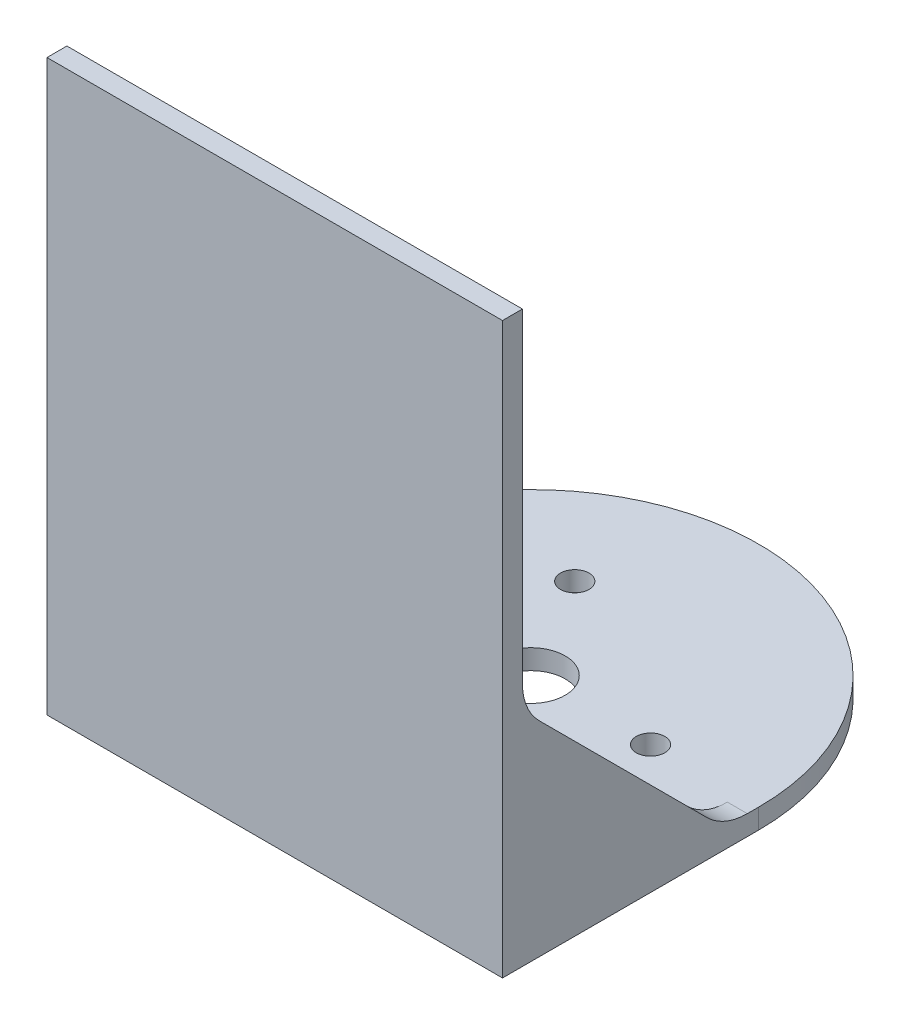
ISO-10303-21;
HEADER;
FILE_DESCRIPTION(('STEP AP214'),'2;1');
FILE_NAME('part.step','',(''),(''),'','','');
FILE_SCHEMA(('AUTOMOTIVE_DESIGN { 1 0 10303 214 1 1 1 1 }'));
ENDSEC;
DATA;
#1=APPLICATION_CONTEXT('core data for automotive mechanical design processes');
#2=APPLICATION_PROTOCOL_DEFINITION('international standard','automotive_design',2000,#1);
#3=PRODUCT_CONTEXT('',#1,'mechanical');
#4=PRODUCT('Part','Part','',(#3));
#5=PRODUCT_RELATED_PRODUCT_CATEGORY('part','',(#4));
#6=PRODUCT_DEFINITION_FORMATION('','',#4);
#7=PRODUCT_DEFINITION_CONTEXT('part definition',#1,'design');
#8=PRODUCT_DEFINITION('design','',#6,#7);
#9=PRODUCT_DEFINITION_SHAPE('','',#8);
#10=(LENGTH_UNIT() NAMED_UNIT(*) SI_UNIT(.MILLI.,.METRE.));
#11=(NAMED_UNIT(*) PLANE_ANGLE_UNIT() SI_UNIT($,.RADIAN.));
#12=(NAMED_UNIT(*) SI_UNIT($,.STERADIAN.) SOLID_ANGLE_UNIT());
#13=UNCERTAINTY_MEASURE_WITH_UNIT(LENGTH_MEASURE(1.E-05),#10,'distance_accuracy_value','');
#14=(GEOMETRIC_REPRESENTATION_CONTEXT(3) GLOBAL_UNCERTAINTY_ASSIGNED_CONTEXT((#13)) GLOBAL_UNIT_ASSIGNED_CONTEXT((#10,
#11,#12)) REPRESENTATION_CONTEXT('',''));
#15=CARTESIAN_POINT('',(0.,0.,0.));
#16=DIRECTION('',(0.,0.,1.));
#17=DIRECTION('',(1.,0.,0.));
#18=AXIS2_PLACEMENT_3D('',#15,#16,#17);
#19=CARTESIAN_POINT('',(0.,3.5,0.));
#20=DIRECTION('',(0.,1.,0.));
#21=DIRECTION('',(0.,0.,1.));
#22=AXIS2_PLACEMENT_3D('',#19,#20,#21);
#23=PLANE('',#22);
#24=CARTESIAN_POINT('',(-10.4999999999998,3.5,-18.1865334794733));
#25=DIRECTION('',(0.,1.,0.));
#26=DIRECTION('',(0.,0.,1.));
#27=AXIS2_PLACEMENT_3D('',#24,#25,#26);
#28=CIRCLE('',#27,2.5);
#29=CARTESIAN_POINT('',(-10.4999999999998,3.5,-15.6865334794733));
#30=VERTEX_POINT('',#29);
#31=EDGE_CURVE('E201',#30,#30,#28,.T.);
#32=ORIENTED_EDGE('',*,*,#31,.F.);
#33=EDGE_LOOP('',(#32));
#34=FACE_BOUND('',#33,.T.);
#35=CARTESIAN_POINT('',(21.,3.5,0.));
#36=DIRECTION('',(0.,1.,0.));
#37=DIRECTION('',(0.,0.,1.));
#38=AXIS2_PLACEMENT_3D('',#35,#36,#37);
#39=CIRCLE('',#38,2.5);
#40=CARTESIAN_POINT('',(21.,3.5,2.5));
#41=VERTEX_POINT('',#40);
#42=EDGE_CURVE('E255',#41,#41,#39,.T.);
#43=ORIENTED_EDGE('',*,*,#42,.F.);
#44=EDGE_LOOP('',(#43));
#45=FACE_BOUND('',#44,.T.);
#46=CARTESIAN_POINT('',(-10.5000000000001,3.5,18.1865334794732));
#47=DIRECTION('',(0.,1.,0.));
#48=DIRECTION('',(0.,0.,1.));
#49=AXIS2_PLACEMENT_3D('',#46,#47,#48);
#50=CIRCLE('',#49,2.5);
#51=CARTESIAN_POINT('',(-10.5000000000001,3.5,20.6865334794732));
#52=VERTEX_POINT('',#51);
#53=EDGE_CURVE('E168',#52,#52,#50,.T.);
#54=ORIENTED_EDGE('',*,*,#53,.F.);
#55=EDGE_LOOP('',(#54));
#56=FACE_BOUND('',#55,.T.);
#57=CARTESIAN_POINT('',(0.,3.5,0.));
#58=DIRECTION('',(0.,1.,0.));
#59=DIRECTION('',(0.,0.,1.));
#60=AXIS2_PLACEMENT_3D('',#57,#58,#59);
#61=CIRCLE('',#60,6.);
#62=CARTESIAN_POINT('',(0.,3.5,6.));
#63=VERTEX_POINT('',#62);
#64=EDGE_CURVE('E176',#63,#63,#61,.T.);
#65=ORIENTED_EDGE('',*,*,#64,.F.);
#66=EDGE_LOOP('',(#65));
#67=FACE_BOUND('',#66,.T.);
#68=DIRECTION('',(0.,0.,1.));
#69=VECTOR('',#68,1.);
#70=CARTESIAN_POINT('',(36.5,3.5,6.14466094067268));
#71=LINE('',#70,#69);
#72=CARTESIAN_POINT('',(36.5,3.5,2.00252531694172));
#73=VERTEX_POINT('',#72);
#74=CARTESIAN_POINT('',(36.5,3.5,41.5));
#75=VERTEX_POINT('',#74);
#76=EDGE_CURVE('E238',#73,#75,#71,.T.);
#77=ORIENTED_EDGE('',*,*,#76,.F.);
#78=DIRECTION('',(1.,0.,0.));
#79=VECTOR('',#78,1.);
#80=CARTESIAN_POINT('',(0.,3.5,2.00252531694172));
#81=LINE('',#80,#79);
#82=CARTESIAN_POINT('',(40.,3.5,2.00252531694172));
#83=VERTEX_POINT('',#82);
#84=EDGE_CURVE('E220',#73,#83,#81,.T.);
#85=ORIENTED_EDGE('',*,*,#84,.T.);
#86=DIRECTION('',(0.,0.,-1.));
#87=VECTOR('',#86,1.);
#88=CARTESIAN_POINT('',(40.,3.5,0.));
#89=LINE('',#88,#87);
#90=CARTESIAN_POINT('',(40.,3.5,0.));
#91=VERTEX_POINT('',#90);
#92=EDGE_CURVE('E165',#83,#91,#89,.T.);
#93=ORIENTED_EDGE('',*,*,#92,.T.);
#94=CARTESIAN_POINT('',(0.,3.5,0.));
#95=DIRECTION('',(0.,1.,0.));
#96=DIRECTION('',(0.,0.,1.));
#97=AXIS2_PLACEMENT_3D('',#94,#95,#96);
#98=CIRCLE('',#97,40.);
#99=CARTESIAN_POINT('',(-40.,3.5,0.));
#100=VERTEX_POINT('',#99);
#101=EDGE_CURVE('E170',#100,#91,#98,.F.);
#102=ORIENTED_EDGE('',*,*,#101,.F.);
#103=DIRECTION('',(0.,0.,1.));
#104=VECTOR('',#103,1.);
#105=CARTESIAN_POINT('',(-40.,3.5,0.));
#106=LINE('',#105,#104);
#107=CARTESIAN_POINT('',(-40.,3.5,2.00252531694172));
#108=VERTEX_POINT('',#107);
#109=EDGE_CURVE('E166',#100,#108,#106,.T.);
#110=ORIENTED_EDGE('',*,*,#109,.T.);
#111=DIRECTION('',(-1.,0.,0.));
#112=VECTOR('',#111,1.);
#113=CARTESIAN_POINT('',(-36.5,3.5,2.00252531694172));
#114=LINE('',#113,#112);
#115=CARTESIAN_POINT('',(-36.5,3.5,2.00252531694172));
#116=VERTEX_POINT('',#115);
#117=EDGE_CURVE('E160',#108,#116,#114,.F.);
#118=ORIENTED_EDGE('',*,*,#117,.T.);
#119=DIRECTION('',(0.,0.,1.));
#120=VECTOR('',#119,1.);
#121=CARTESIAN_POINT('',(-36.5,3.5,6.14466094067268));
#122=LINE('',#121,#120);
#123=CARTESIAN_POINT('',(-36.5,3.5,41.5));
#124=VERTEX_POINT('',#123);
#125=EDGE_CURVE('E144',#116,#124,#122,.T.);
#126=ORIENTED_EDGE('',*,*,#125,.T.);
#127=DIRECTION('',(1.,0.,0.));
#128=VECTOR('',#127,1.);
#129=CARTESIAN_POINT('',(0.,3.5,41.5));
#130=LINE('',#129,#128);
#131=EDGE_CURVE('E157',#124,#75,#130,.T.);
#132=ORIENTED_EDGE('',*,*,#131,.T.);
#133=EDGE_LOOP('',(#77,#85,#93,#102,#110,#118,#126,#132));
#134=FACE_BOUND('',#133,.T.);
#135=ADVANCED_FACE('F42',(#34,#45,#56,#67,#134),#23,.T.);
#136=CARTESIAN_POINT('',(0.,100.,41.5));
#137=DIRECTION('',(0.,0.,-1.));
#138=DIRECTION('',(-1.,0.,0.));
#139=AXIS2_PLACEMENT_3D('',#136,#137,#138);
#140=PLANE('',#139);
#141=DIRECTION('',(0.,-1.,0.));
#142=VECTOR('',#141,1.);
#143=CARTESIAN_POINT('',(40.,100.,41.5));
#144=LINE('',#143,#142);
#145=CARTESIAN_POINT('',(40.,100.,41.5));
#146=VERTEX_POINT('',#145);
#147=CARTESIAN_POINT('',(40.,42.9974746830584,41.5));
#148=VERTEX_POINT('',#147);
#149=EDGE_CURVE('E268',#146,#148,#144,.T.);
#150=ORIENTED_EDGE('',*,*,#149,.T.);
#151=DIRECTION('',(1.,0.,0.));
#152=VECTOR('',#151,1.);
#153=CARTESIAN_POINT('',(0.,42.9974746830584,41.5));
#154=LINE('',#153,#152);
#155=CARTESIAN_POINT('',(36.5,42.9974746830584,41.5));
#156=VERTEX_POINT('',#155);
#157=EDGE_CURVE('E228',#148,#156,#154,.F.);
#158=ORIENTED_EDGE('',*,*,#157,.T.);
#159=DIRECTION('',(0.,1.,0.));
#160=VECTOR('',#159,1.);
#161=CARTESIAN_POINT('',(36.5,3.5,41.5));
#162=LINE('',#161,#160);
#163=EDGE_CURVE('E56',#75,#156,#162,.T.);
#164=ORIENTED_EDGE('',*,*,#163,.F.);
#165=ORIENTED_EDGE('',*,*,#131,.F.);
#166=DIRECTION('',(0.,1.,0.));
#167=VECTOR('',#166,1.);
#168=CARTESIAN_POINT('',(-36.5,3.5,41.5));
#169=LINE('',#168,#167);
#170=CARTESIAN_POINT('',(-36.5,42.9974746830584,41.5));
#171=VERTEX_POINT('',#170);
#172=EDGE_CURVE('E141',#124,#171,#169,.T.);
#173=ORIENTED_EDGE('',*,*,#172,.T.);
#174=DIRECTION('',(-1.,0.,0.));
#175=VECTOR('',#174,1.);
#176=CARTESIAN_POINT('',(-40.,42.9974746830584,41.5));
#177=LINE('',#176,#175);
#178=CARTESIAN_POINT('',(-40.,42.9974746830584,41.5));
#179=VERTEX_POINT('',#178);
#180=EDGE_CURVE('E211',#171,#179,#177,.T.);
#181=ORIENTED_EDGE('',*,*,#180,.T.);
#182=DIRECTION('',(0.,-1.,0.));
#183=VECTOR('',#182,1.);
#184=CARTESIAN_POINT('',(-40.,100.,41.5));
#185=LINE('',#184,#183);
#186=CARTESIAN_POINT('',(-40.,100.,41.5));
#187=VERTEX_POINT('',#186);
#188=EDGE_CURVE('E184',#187,#179,#185,.T.);
#189=ORIENTED_EDGE('',*,*,#188,.F.);
#190=DIRECTION('',(1.,0.,0.));
#191=VECTOR('',#190,1.);
#192=CARTESIAN_POINT('',(0.,100.,41.5));
#193=LINE('',#192,#191);
#194=EDGE_CURVE('E274',#187,#146,#193,.T.);
#195=ORIENTED_EDGE('',*,*,#194,.T.);
#196=EDGE_LOOP('',(#150,#158,#164,#165,#173,#181,#189,#195));
#197=FACE_BOUND('',#196,.T.);
#198=ADVANCED_FACE('F164',(#197),#140,.T.);
#199=CARTESIAN_POINT('',(0.,3.5,0.));
#200=DIRECTION('',(0.,-1.,0.));
#201=DIRECTION('',(0.,0.,-1.));
#202=AXIS2_PLACEMENT_3D('',#199,#200,#201);
#203=CYLINDRICAL_SURFACE('',#202,40.);
#204=CARTESIAN_POINT('',(0.,0.,0.));
#205=DIRECTION('',(0.,1.,0.));
#206=DIRECTION('',(0.,0.,1.));
#207=AXIS2_PLACEMENT_3D('',#204,#205,#206);
#208=CIRCLE('',#207,40.);
#209=CARTESIAN_POINT('',(-40.,0.,0.));
#210=VERTEX_POINT('',#209);
#211=CARTESIAN_POINT('',(40.,0.,0.));
#212=VERTEX_POINT('',#211);
#213=EDGE_CURVE('E187',#210,#212,#208,.F.);
#214=ORIENTED_EDGE('',*,*,#213,.F.);
#215=DIRECTION('',(0.,-1.,0.));
#216=VECTOR('',#215,1.);
#217=CARTESIAN_POINT('',(-40.,3.5,0.));
#218=LINE('',#217,#216);
#219=EDGE_CURVE('E203',#100,#210,#218,.T.);
#220=ORIENTED_EDGE('',*,*,#219,.F.);
#221=ORIENTED_EDGE('',*,*,#101,.T.);
#222=DIRECTION('',(0.,-1.,0.));
#223=VECTOR('',#222,1.);
#224=CARTESIAN_POINT('',(40.,3.5,0.));
#225=LINE('',#224,#223);
#226=EDGE_CURVE('E179',#91,#212,#225,.T.);
#227=ORIENTED_EDGE('',*,*,#226,.T.);
#228=EDGE_LOOP('',(#214,#220,#221,#227));
#229=FACE_BOUND('',#228,.T.);
#230=ADVANCED_FACE('F253',(#229),#203,.T.);
#231=CARTESIAN_POINT('',(-40.,3.5,0.));
#232=DIRECTION('',(1.,0.,0.));
#233=DIRECTION('',(0.,0.,-1.));
#234=AXIS2_PLACEMENT_3D('',#231,#232,#233);
#235=PLANE('',#234);
#236=DIRECTION('',(0.,0.,1.));
#237=VECTOR('',#236,1.);
#238=CARTESIAN_POINT('',(-40.,0.,0.));
#239=LINE('',#238,#237);
#240=CARTESIAN_POINT('',(-40.,0.,45.));
#241=VERTEX_POINT('',#240);
#242=EDGE_CURVE('E190',#210,#241,#239,.T.);
#243=ORIENTED_EDGE('',*,*,#242,.T.);
#244=DIRECTION('',(0.,-1.,0.));
#245=VECTOR('',#244,1.);
#246=CARTESIAN_POINT('',(-40.,100.,45.));
#247=LINE('',#246,#245);
#248=CARTESIAN_POINT('',(-40.,100.,45.));
#249=VERTEX_POINT('',#248);
#250=EDGE_CURVE('E263',#249,#241,#247,.T.);
#251=ORIENTED_EDGE('',*,*,#250,.F.);
#252=DIRECTION('',(0.,0.,1.));
#253=VECTOR('',#252,1.);
#254=CARTESIAN_POINT('',(-40.,100.,0.));
#255=LINE('',#254,#253);
#256=EDGE_CURVE('E278',#187,#249,#255,.T.);
#257=ORIENTED_EDGE('',*,*,#256,.F.);
#258=ORIENTED_EDGE('',*,*,#188,.T.);
#259=CARTESIAN_POINT('',(-40.,42.9974746830584,31.5));
#260=DIRECTION('',(1.,0.,0.));
#261=DIRECTION('',(0.,0.,-1.));
#262=AXIS2_PLACEMENT_3D('',#259,#260,#261);
#263=CIRCLE('',#262,10.);
#264=CARTESIAN_POINT('',(-40.,35.9264068711929,38.5710678118655));
#265=VERTEX_POINT('',#264);
#266=EDGE_CURVE('E217',#179,#265,#263,.T.);
#267=ORIENTED_EDGE('',*,*,#266,.T.);
#268=DIRECTION('',(0.,-0.707106781186549,-0.707106781186546));
#269=VECTOR('',#268,1.);
#270=CARTESIAN_POINT('',(-40.,3.5,6.14466094067268));
#271=LINE('',#270,#269);
#272=CARTESIAN_POINT('',(-40.,6.42893218813454,9.07359312880721));
#273=VERTEX_POINT('',#272);
#274=EDGE_CURVE('E162',#265,#273,#271,.T.);
#275=ORIENTED_EDGE('',*,*,#274,.T.);
#276=CARTESIAN_POINT('',(-40.,13.5,2.00252531694172));
#277=DIRECTION('',(1.,0.,0.));
#278=DIRECTION('',(0.,0.,-1.));
#279=AXIS2_PLACEMENT_3D('',#276,#277,#278);
#280=CIRCLE('',#279,10.);
#281=EDGE_CURVE('E213',#273,#108,#280,.T.);
#282=ORIENTED_EDGE('',*,*,#281,.T.);
#283=ORIENTED_EDGE('',*,*,#109,.F.);
#284=ORIENTED_EDGE('',*,*,#219,.T.);
#285=EDGE_LOOP('',(#243,#251,#257,#258,#267,#275,#282,#283,#284));
#286=FACE_BOUND('',#285,.T.);
#287=ADVANCED_FACE('F312',(#286),#235,.F.);
#288=CARTESIAN_POINT('',(-10.5000000000001,3.5,18.1865334794732));
#289=DIRECTION('',(0.,-1.,0.));
#290=DIRECTION('',(0.,0.,-1.));
#291=AXIS2_PLACEMENT_3D('',#288,#289,#290);
#292=CYLINDRICAL_SURFACE('',#291,2.5);
#293=ORIENTED_EDGE('',*,*,#53,.T.);
#294=EDGE_LOOP('',(#293));
#295=FACE_BOUND('',#294,.T.);
#296=CARTESIAN_POINT('',(-10.5000000000001,0.,18.1865334794732));
#297=DIRECTION('',(0.,1.,0.));
#298=DIRECTION('',(0.,0.,1.));
#299=AXIS2_PLACEMENT_3D('',#296,#297,#298);
#300=CIRCLE('',#299,2.5);
#301=CARTESIAN_POINT('',(-10.5000000000001,0.,20.6865334794732));
#302=VERTEX_POINT('',#301);
#303=EDGE_CURVE('E195',#302,#302,#300,.T.);
#304=ORIENTED_EDGE('',*,*,#303,.F.);
#305=EDGE_LOOP('',(#304));
#306=FACE_BOUND('',#305,.T.);
#307=ADVANCED_FACE('F349',(#295,#306),#292,.F.);
#308=CARTESIAN_POINT('',(40.,3.5,0.));
#309=DIRECTION('',(-1.,0.,0.));
#310=DIRECTION('',(0.,0.,1.));
#311=AXIS2_PLACEMENT_3D('',#308,#309,#310);
#312=PLANE('',#311);
#313=ORIENTED_EDGE('',*,*,#92,.F.);
#314=CARTESIAN_POINT('',(40.,13.5,2.00252531694172));
#315=DIRECTION('',(-1.,0.,0.));
#316=DIRECTION('',(0.,0.,1.));
#317=AXIS2_PLACEMENT_3D('',#314,#315,#316);
#318=CIRCLE('',#317,10.);
#319=CARTESIAN_POINT('',(40.,6.42893218813454,9.07359312880721));
#320=VERTEX_POINT('',#319);
#321=EDGE_CURVE('E230',#83,#320,#318,.T.);
#322=ORIENTED_EDGE('',*,*,#321,.T.);
#323=DIRECTION('',(0.,-0.707106781186549,-0.707106781186546));
#324=VECTOR('',#323,1.);
#325=CARTESIAN_POINT('',(40.,3.5,6.14466094067268));
#326=LINE('',#325,#324);
#327=CARTESIAN_POINT('',(40.,35.9264068711929,38.5710678118655));
#328=VERTEX_POINT('',#327);
#329=EDGE_CURVE('E286',#328,#320,#326,.T.);
#330=ORIENTED_EDGE('',*,*,#329,.F.);
#331=CARTESIAN_POINT('',(40.,42.9974746830584,31.5));
#332=DIRECTION('',(-1.,0.,0.));
#333=DIRECTION('',(0.,0.,1.));
#334=AXIS2_PLACEMENT_3D('',#331,#332,#333);
#335=CIRCLE('',#334,10.);
#336=EDGE_CURVE('E50',#328,#148,#335,.T.);
#337=ORIENTED_EDGE('',*,*,#336,.T.);
#338=ORIENTED_EDGE('',*,*,#149,.F.);
#339=DIRECTION('',(0.,0.,-1.));
#340=VECTOR('',#339,1.);
#341=CARTESIAN_POINT('',(40.,100.,0.));
#342=LINE('',#341,#340);
#343=CARTESIAN_POINT('',(40.,100.,45.));
#344=VERTEX_POINT('',#343);
#345=EDGE_CURVE('E270',#344,#146,#342,.T.);
#346=ORIENTED_EDGE('',*,*,#345,.F.);
#347=DIRECTION('',(0.,-1.,0.));
#348=VECTOR('',#347,1.);
#349=CARTESIAN_POINT('',(40.,100.,45.));
#350=LINE('',#349,#348);
#351=CARTESIAN_POINT('',(40.,0.,45.));
#352=VERTEX_POINT('',#351);
#353=EDGE_CURVE('E266',#344,#352,#350,.T.);
#354=ORIENTED_EDGE('',*,*,#353,.T.);
#355=DIRECTION('',(0.,0.,-1.));
#356=VECTOR('',#355,1.);
#357=CARTESIAN_POINT('',(40.,0.,0.));
#358=LINE('',#357,#356);
#359=EDGE_CURVE('E192',#352,#212,#358,.T.);
#360=ORIENTED_EDGE('',*,*,#359,.T.);
#361=ORIENTED_EDGE('',*,*,#226,.F.);
#362=EDGE_LOOP('',(#313,#322,#330,#337,#338,#346,#354,#360,#361));
#363=FACE_BOUND('',#362,.T.);
#364=ADVANCED_FACE('F247',(#363),#312,.F.);
#365=CARTESIAN_POINT('',(21.,3.5,0.));
#366=DIRECTION('',(0.,-1.,0.));
#367=DIRECTION('',(0.,0.,-1.));
#368=AXIS2_PLACEMENT_3D('',#365,#366,#367);
#369=CYLINDRICAL_SURFACE('',#368,2.5);
#370=ORIENTED_EDGE('',*,*,#42,.T.);
#371=EDGE_LOOP('',(#370));
#372=FACE_BOUND('',#371,.T.);
#373=CARTESIAN_POINT('',(21.,0.,0.));
#374=DIRECTION('',(0.,1.,0.));
#375=DIRECTION('',(0.,0.,1.));
#376=AXIS2_PLACEMENT_3D('',#373,#374,#375);
#377=CIRCLE('',#376,2.5);
#378=CARTESIAN_POINT('',(21.,0.,2.5));
#379=VERTEX_POINT('',#378);
#380=EDGE_CURVE('E183',#379,#379,#377,.T.);
#381=ORIENTED_EDGE('',*,*,#380,.F.);
#382=EDGE_LOOP('',(#381));
#383=FACE_BOUND('',#382,.T.);
#384=ADVANCED_FACE('F355',(#372,#383),#369,.F.);
#385=CARTESIAN_POINT('',(-10.4999999999998,3.5,-18.1865334794733));
#386=DIRECTION('',(0.,-1.,0.));
#387=DIRECTION('',(0.,0.,-1.));
#388=AXIS2_PLACEMENT_3D('',#385,#386,#387);
#389=CYLINDRICAL_SURFACE('',#388,2.5);
#390=ORIENTED_EDGE('',*,*,#31,.T.);
#391=EDGE_LOOP('',(#390));
#392=FACE_BOUND('',#391,.T.);
#393=CARTESIAN_POINT('',(-10.4999999999998,0.,-18.1865334794733));
#394=DIRECTION('',(0.,1.,0.));
#395=DIRECTION('',(0.,0.,1.));
#396=AXIS2_PLACEMENT_3D('',#393,#394,#395);
#397=CIRCLE('',#396,2.5);
#398=CARTESIAN_POINT('',(-10.4999999999998,0.,-15.6865334794733));
#399=VERTEX_POINT('',#398);
#400=EDGE_CURVE('E180',#399,#399,#397,.T.);
#401=ORIENTED_EDGE('',*,*,#400,.F.);
#402=EDGE_LOOP('',(#401));
#403=FACE_BOUND('',#402,.T.);
#404=ADVANCED_FACE('F347',(#392,#403),#389,.F.);
#405=CARTESIAN_POINT('',(0.,3.5,0.));
#406=DIRECTION('',(0.,-1.,0.));
#407=DIRECTION('',(0.,0.,-1.));
#408=AXIS2_PLACEMENT_3D('',#405,#406,#407);
#409=CYLINDRICAL_SURFACE('',#408,6.);
#410=ORIENTED_EDGE('',*,*,#64,.T.);
#411=EDGE_LOOP('',(#410));
#412=FACE_BOUND('',#411,.T.);
#413=CARTESIAN_POINT('',(0.,0.,0.));
#414=DIRECTION('',(0.,1.,0.));
#415=DIRECTION('',(0.,0.,1.));
#416=AXIS2_PLACEMENT_3D('',#413,#414,#415);
#417=CIRCLE('',#416,6.);
#418=CARTESIAN_POINT('',(0.,0.,6.));
#419=VERTEX_POINT('',#418);
#420=EDGE_CURVE('E198',#419,#419,#417,.T.);
#421=ORIENTED_EDGE('',*,*,#420,.F.);
#422=EDGE_LOOP('',(#421));
#423=FACE_BOUND('',#422,.T.);
#424=ADVANCED_FACE('F343',(#412,#423),#409,.F.);
#425=CARTESIAN_POINT('',(0.,0.,0.));
#426=DIRECTION('',(0.,1.,0.));
#427=DIRECTION('',(0.,0.,1.));
#428=AXIS2_PLACEMENT_3D('',#425,#426,#427);
#429=PLANE('',#428);
#430=ORIENTED_EDGE('',*,*,#400,.T.);
#431=EDGE_LOOP('',(#430));
#432=FACE_BOUND('',#431,.T.);
#433=ORIENTED_EDGE('',*,*,#380,.T.);
#434=EDGE_LOOP('',(#433));
#435=FACE_BOUND('',#434,.T.);
#436=ORIENTED_EDGE('',*,*,#213,.T.);
#437=ORIENTED_EDGE('',*,*,#359,.F.);
#438=DIRECTION('',(1.,0.,0.));
#439=VECTOR('',#438,1.);
#440=CARTESIAN_POINT('',(0.,0.,45.));
#441=LINE('',#440,#439);
#442=EDGE_CURVE('E271',#241,#352,#441,.T.);
#443=ORIENTED_EDGE('',*,*,#442,.F.);
#444=ORIENTED_EDGE('',*,*,#242,.F.);
#445=EDGE_LOOP('',(#436,#437,#443,#444));
#446=FACE_BOUND('',#445,.T.);
#447=ORIENTED_EDGE('',*,*,#303,.T.);
#448=EDGE_LOOP('',(#447));
#449=FACE_BOUND('',#448,.T.);
#450=ORIENTED_EDGE('',*,*,#420,.T.);
#451=EDGE_LOOP('',(#450));
#452=FACE_BOUND('',#451,.T.);
#453=ADVANCED_FACE('F309',(#432,#435,#446,#449,#452),#429,.F.);
#454=CARTESIAN_POINT('',(0.,100.,45.));
#455=DIRECTION('',(0.,0.,-1.));
#456=DIRECTION('',(-1.,0.,0.));
#457=AXIS2_PLACEMENT_3D('',#454,#455,#456);
#458=PLANE('',#457);
#459=ORIENTED_EDGE('',*,*,#442,.T.);
#460=ORIENTED_EDGE('',*,*,#353,.F.);
#461=DIRECTION('',(1.,0.,0.));
#462=VECTOR('',#461,1.);
#463=CARTESIAN_POINT('',(0.,100.,45.));
#464=LINE('',#463,#462);
#465=EDGE_CURVE('E276',#249,#344,#464,.T.);
#466=ORIENTED_EDGE('',*,*,#465,.F.);
#467=ORIENTED_EDGE('',*,*,#250,.T.);
#468=EDGE_LOOP('',(#459,#460,#466,#467));
#469=FACE_BOUND('',#468,.T.);
#470=ADVANCED_FACE('F305',(#469),#458,.F.);
#471=CARTESIAN_POINT('',(0.,100.,0.));
#472=DIRECTION('',(0.,1.,0.));
#473=DIRECTION('',(0.,0.,1.));
#474=AXIS2_PLACEMENT_3D('',#471,#472,#473);
#475=PLANE('',#474);
#476=ORIENTED_EDGE('',*,*,#194,.F.);
#477=ORIENTED_EDGE('',*,*,#256,.T.);
#478=ORIENTED_EDGE('',*,*,#465,.T.);
#479=ORIENTED_EDGE('',*,*,#345,.T.);
#480=EDGE_LOOP('',(#476,#477,#478,#479));
#481=FACE_BOUND('',#480,.T.);
#482=ADVANCED_FACE('F300',(#481),#475,.T.);
#483=CARTESIAN_POINT('',(-36.5,3.5,6.14466094067268));
#484=DIRECTION('',(0.,0.707106781186546,-0.707106781186549));
#485=DIRECTION('',(0.,0.707106781186549,0.707106781186546));
#486=AXIS2_PLACEMENT_3D('',#483,#484,#485);
#487=PLANE('',#486);
#488=DIRECTION('',(0.,-0.707106781186549,-0.707106781186546));
#489=VECTOR('',#488,1.);
#490=CARTESIAN_POINT('',(-36.5,3.5,6.14466094067268));
#491=LINE('',#490,#489);
#492=CARTESIAN_POINT('',(-36.5,35.9264068711929,38.5710678118655));
#493=VERTEX_POINT('',#492);
#494=CARTESIAN_POINT('',(-36.5,6.42893218813454,9.07359312880721));
#495=VERTEX_POINT('',#494);
#496=EDGE_CURVE('E153',#493,#495,#491,.T.);
#497=ORIENTED_EDGE('',*,*,#496,.T.);
#498=DIRECTION('',(-1.,0.,0.));
#499=VECTOR('',#498,1.);
#500=CARTESIAN_POINT('',(-40.,6.42893218813454,9.07359312880721));
#501=LINE('',#500,#499);
#502=EDGE_CURVE('E207',#495,#273,#501,.T.);
#503=ORIENTED_EDGE('',*,*,#502,.T.);
#504=ORIENTED_EDGE('',*,*,#274,.F.);
#505=DIRECTION('',(-1.,0.,0.));
#506=VECTOR('',#505,1.);
#507=CARTESIAN_POINT('',(-36.5,35.9264068711929,38.5710678118655));
#508=LINE('',#507,#506);
#509=EDGE_CURVE('E205',#265,#493,#508,.F.);
#510=ORIENTED_EDGE('',*,*,#509,.T.);
#511=EDGE_LOOP('',(#497,#503,#504,#510));
#512=FACE_BOUND('',#511,.T.);
#513=ADVANCED_FACE('F317',(#512),#487,.T.);
#514=CARTESIAN_POINT('',(-36.5,0.,0.));
#515=DIRECTION('',(-1.,0.,0.));
#516=DIRECTION('',(0.,0.,1.));
#517=AXIS2_PLACEMENT_3D('',#514,#515,#516);
#518=PLANE('',#517);
#519=ORIENTED_EDGE('',*,*,#125,.F.);
#520=CARTESIAN_POINT('',(-36.5,13.5,2.00252531694172));
#521=DIRECTION('',(-1.,0.,0.));
#522=DIRECTION('',(0.,0.,1.));
#523=AXIS2_PLACEMENT_3D('',#520,#521,#522);
#524=CIRCLE('',#523,10.);
#525=EDGE_CURVE('E215',#116,#495,#524,.T.);
#526=ORIENTED_EDGE('',*,*,#525,.T.);
#527=ORIENTED_EDGE('',*,*,#496,.F.);
#528=CARTESIAN_POINT('',(-36.5,42.9974746830584,31.5));
#529=DIRECTION('',(-1.,0.,0.));
#530=DIRECTION('',(0.,0.,1.));
#531=AXIS2_PLACEMENT_3D('',#528,#529,#530);
#532=CIRCLE('',#531,10.);
#533=EDGE_CURVE('E148',#493,#171,#532,.T.);
#534=ORIENTED_EDGE('',*,*,#533,.T.);
#535=ORIENTED_EDGE('',*,*,#172,.F.);
#536=EDGE_LOOP('',(#519,#526,#527,#534,#535));
#537=FACE_BOUND('',#536,.T.);
#538=ADVANCED_FACE('F143',(#537),#518,.F.);
#539=CARTESIAN_POINT('',(-36.5,13.5,2.00252531694172));
#540=DIRECTION('',(1.,0.,0.));
#541=DIRECTION('',(0.,0.,-1.));
#542=AXIS2_PLACEMENT_3D('',#539,#540,#541);
#543=CYLINDRICAL_SURFACE('',#542,10.);
#544=ORIENTED_EDGE('',*,*,#525,.F.);
#545=ORIENTED_EDGE('',*,*,#117,.F.);
#546=ORIENTED_EDGE('',*,*,#281,.F.);
#547=ORIENTED_EDGE('',*,*,#502,.F.);
#548=EDGE_LOOP('',(#544,#545,#546,#547));
#549=FACE_BOUND('',#548,.T.);
#550=ADVANCED_FACE('F314',(#549),#543,.F.);
#551=CARTESIAN_POINT('',(0.,42.9974746830584,31.5));
#552=DIRECTION('',(1.,0.,0.));
#553=DIRECTION('',(0.,1.,0.));
#554=AXIS2_PLACEMENT_3D('',#551,#552,#553);
#555=CYLINDRICAL_SURFACE('',#554,10.);
#556=ORIENTED_EDGE('',*,*,#533,.F.);
#557=ORIENTED_EDGE('',*,*,#509,.F.);
#558=ORIENTED_EDGE('',*,*,#266,.F.);
#559=ORIENTED_EDGE('',*,*,#180,.F.);
#560=EDGE_LOOP('',(#556,#557,#558,#559));
#561=FACE_BOUND('',#560,.T.);
#562=ADVANCED_FACE('F321',(#561),#555,.F.);
#563=CARTESIAN_POINT('',(36.5,3.5,6.14466094067268));
#564=DIRECTION('',(0.,-0.707106781186546,0.707106781186549));
#565=DIRECTION('',(0.,-0.707106781186549,-0.707106781186546));
#566=AXIS2_PLACEMENT_3D('',#563,#564,#565);
#567=PLANE('',#566);
#568=ORIENTED_EDGE('',*,*,#329,.T.);
#569=DIRECTION('',(1.,0.,0.));
#570=VECTOR('',#569,1.);
#571=CARTESIAN_POINT('',(36.5,6.42893218813454,9.07359312880721));
#572=LINE('',#571,#570);
#573=CARTESIAN_POINT('',(36.5,6.42893218813454,9.07359312880721));
#574=VERTEX_POINT('',#573);
#575=EDGE_CURVE('E226',#320,#574,#572,.F.);
#576=ORIENTED_EDGE('',*,*,#575,.T.);
#577=DIRECTION('',(0.,-0.707106781186549,-0.707106781186546));
#578=VECTOR('',#577,1.);
#579=CARTESIAN_POINT('',(36.5,3.5,6.14466094067268));
#580=LINE('',#579,#578);
#581=CARTESIAN_POINT('',(36.5,35.9264068711929,38.5710678118655));
#582=VERTEX_POINT('',#581);
#583=EDGE_CURVE('E240',#582,#574,#580,.T.);
#584=ORIENTED_EDGE('',*,*,#583,.F.);
#585=DIRECTION('',(1.,0.,0.));
#586=VECTOR('',#585,1.);
#587=CARTESIAN_POINT('',(36.5,35.9264068711929,38.5710678118655));
#588=LINE('',#587,#586);
#589=EDGE_CURVE('E223',#582,#328,#588,.T.);
#590=ORIENTED_EDGE('',*,*,#589,.T.);
#591=EDGE_LOOP('',(#568,#576,#584,#590));
#592=FACE_BOUND('',#591,.T.);
#593=ADVANCED_FACE('F291',(#592),#567,.F.);
#594=CARTESIAN_POINT('',(36.5,0.,0.));
#595=DIRECTION('',(1.,0.,0.));
#596=DIRECTION('',(0.,0.,1.));
#597=AXIS2_PLACEMENT_3D('',#594,#595,#596);
#598=PLANE('',#597);
#599=ORIENTED_EDGE('',*,*,#76,.T.);
#600=ORIENTED_EDGE('',*,*,#163,.T.);
#601=CARTESIAN_POINT('',(36.5,42.9974746830584,31.5));
#602=DIRECTION('',(1.,0.,0.));
#603=DIRECTION('',(0.,0.,-1.));
#604=AXIS2_PLACEMENT_3D('',#601,#602,#603);
#605=CIRCLE('',#604,10.);
#606=EDGE_CURVE('E11',#156,#582,#605,.T.);
#607=ORIENTED_EDGE('',*,*,#606,.T.);
#608=ORIENTED_EDGE('',*,*,#583,.T.);
#609=CARTESIAN_POINT('',(36.5,13.5,2.00252531694172));
#610=DIRECTION('',(1.,0.,0.));
#611=DIRECTION('',(0.,0.,-1.));
#612=AXIS2_PLACEMENT_3D('',#609,#610,#611);
#613=CIRCLE('',#612,10.);
#614=EDGE_CURVE('E232',#574,#73,#613,.T.);
#615=ORIENTED_EDGE('',*,*,#614,.T.);
#616=EDGE_LOOP('',(#599,#600,#607,#608,#615));
#617=FACE_BOUND('',#616,.T.);
#618=ADVANCED_FACE('F237',(#617),#598,.F.);
#619=CARTESIAN_POINT('',(0.,13.5,2.00252531694172));
#620=DIRECTION('',(1.,0.,0.));
#621=DIRECTION('',(0.,0.,-1.));
#622=AXIS2_PLACEMENT_3D('',#619,#620,#621);
#623=CYLINDRICAL_SURFACE('',#622,10.);
#624=ORIENTED_EDGE('',*,*,#614,.F.);
#625=ORIENTED_EDGE('',*,*,#575,.F.);
#626=ORIENTED_EDGE('',*,*,#321,.F.);
#627=ORIENTED_EDGE('',*,*,#84,.F.);
#628=EDGE_LOOP('',(#624,#625,#626,#627));
#629=FACE_BOUND('',#628,.T.);
#630=ADVANCED_FACE('F243',(#629),#623,.F.);
#631=CARTESIAN_POINT('',(36.5,42.9974746830584,31.5));
#632=DIRECTION('',(1.,0.,0.));
#633=DIRECTION('',(0.,1.,0.));
#634=AXIS2_PLACEMENT_3D('',#631,#632,#633);
#635=CYLINDRICAL_SURFACE('',#634,10.);
#636=ORIENTED_EDGE('',*,*,#606,.F.);
#637=ORIENTED_EDGE('',*,*,#157,.F.);
#638=ORIENTED_EDGE('',*,*,#336,.F.);
#639=ORIENTED_EDGE('',*,*,#589,.F.);
#640=EDGE_LOOP('',(#636,#637,#638,#639));
#641=FACE_BOUND('',#640,.T.);
#642=ADVANCED_FACE('F44',(#641),#635,.F.);
#643=CLOSED_SHELL('',(#135,#198,#230,#287,#307,#364,#384,#404,#424,#453,#470,#482,#513,#538,
#550,#562,#593,#618,#630,#642));
#644=MANIFOLD_SOLID_BREP('B2',#643);
#645=ADVANCED_BREP_SHAPE_REPRESENTATION('',(#18,#644),#14);
#646=SHAPE_DEFINITION_REPRESENTATION(#9,#645);
ENDSEC;
END-ISO-10303-21;
